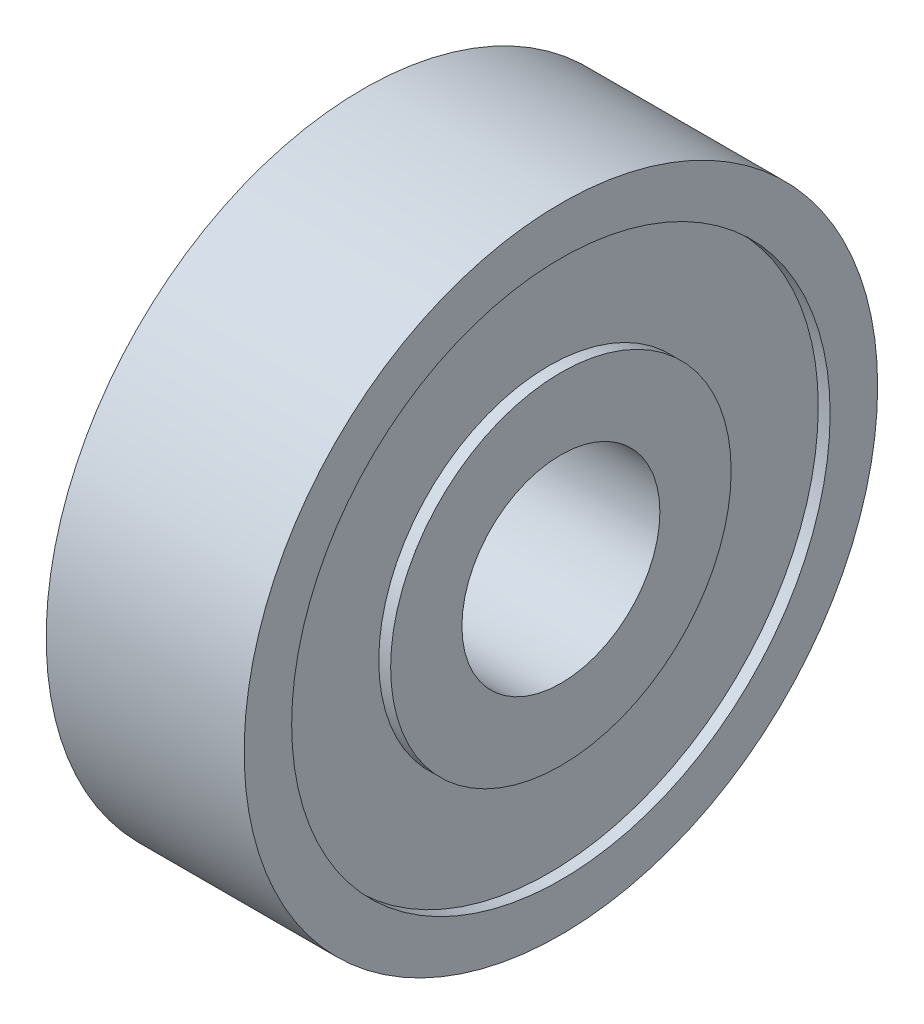
ISO-10303-21;
HEADER;
FILE_DESCRIPTION(('STEP AP214'),'2;1');
FILE_NAME('part.step','',(''),(''),'','','');
FILE_SCHEMA(('AUTOMOTIVE_DESIGN { 1 0 10303 214 1 1 1 1 }'));
ENDSEC;
DATA;
#1=APPLICATION_CONTEXT('core data for automotive mechanical design processes');
#2=APPLICATION_PROTOCOL_DEFINITION('international standard','automotive_design',2000,#1);
#3=PRODUCT_CONTEXT('',#1,'mechanical');
#4=PRODUCT('Part','Part','',(#3));
#5=PRODUCT_RELATED_PRODUCT_CATEGORY('part','',(#4));
#6=PRODUCT_DEFINITION_FORMATION('','',#4);
#7=PRODUCT_DEFINITION_CONTEXT('part definition',#1,'design');
#8=PRODUCT_DEFINITION('design','',#6,#7);
#9=PRODUCT_DEFINITION_SHAPE('','',#8);
#10=(LENGTH_UNIT() NAMED_UNIT(*) SI_UNIT(.MILLI.,.METRE.));
#11=(NAMED_UNIT(*) PLANE_ANGLE_UNIT() SI_UNIT($,.RADIAN.));
#12=(NAMED_UNIT(*) SI_UNIT($,.STERADIAN.) SOLID_ANGLE_UNIT());
#13=UNCERTAINTY_MEASURE_WITH_UNIT(LENGTH_MEASURE(1.E-05),#10,'distance_accuracy_value','');
#14=(GEOMETRIC_REPRESENTATION_CONTEXT(3) GLOBAL_UNCERTAINTY_ASSIGNED_CONTEXT((#13)) GLOBAL_UNIT_ASSIGNED_CONTEXT((#10,
#11,#12)) REPRESENTATION_CONTEXT('',''));
#15=CARTESIAN_POINT('',(0.,0.,0.));
#16=DIRECTION('',(0.,0.,1.));
#17=DIRECTION('',(1.,0.,0.));
#18=AXIS2_PLACEMENT_3D('',#15,#16,#17);
#19=CARTESIAN_POINT('',(-2.5,2.50000000000006,0.));
#20=DIRECTION('',(-1.,0.,0.));
#21=DIRECTION('',(0.,0.,1.));
#22=AXIS2_PLACEMENT_3D('',#19,#20,#21);
#23=PLANE('',#22);
#24=CARTESIAN_POINT('',(-2.5,0.,0.));
#25=DIRECTION('',(1.,0.,0.));
#26=DIRECTION('',(0.,0.,-1.));
#27=AXIS2_PLACEMENT_3D('',#24,#25,#26);
#28=CIRCLE('',#27,2.5);
#29=CARTESIAN_POINT('',(-2.5,0.,-2.5));
#30=VERTEX_POINT('',#29);
#31=EDGE_CURVE('E82',#30,#30,#28,.T.);
#32=ORIENTED_EDGE('',*,*,#31,.T.);
#33=EDGE_LOOP('',(#32));
#34=FACE_BOUND('',#33,.T.);
#35=CARTESIAN_POINT('',(-2.5,0.,0.));
#36=DIRECTION('',(1.,0.,0.));
#37=DIRECTION('',(0.,0.,-1.));
#38=AXIS2_PLACEMENT_3D('',#35,#36,#37);
#39=CIRCLE('',#38,4.3);
#40=CARTESIAN_POINT('',(-2.5,0.,-4.3));
#41=VERTEX_POINT('',#40);
#42=EDGE_CURVE('E12',#41,#41,#39,.T.);
#43=ORIENTED_EDGE('',*,*,#42,.F.);
#44=EDGE_LOOP('',(#43));
#45=FACE_BOUND('',#44,.T.);
#46=ADVANCED_FACE('F42',(#34,#45),#23,.T.);
#47=CARTESIAN_POINT('',(0.,0.,0.));
#48=DIRECTION('',(1.,0.,0.));
#49=DIRECTION('',(0.,0.,-1.));
#50=AXIS2_PLACEMENT_3D('',#47,#48,#49);
#51=CYLINDRICAL_SURFACE('',#50,4.3);
#52=ORIENTED_EDGE('',*,*,#42,.T.);
#53=EDGE_LOOP('',(#52));
#54=FACE_BOUND('',#53,.T.);
#55=CARTESIAN_POINT('',(-2.20000000000004,0.,0.));
#56=DIRECTION('',(1.,0.,0.));
#57=DIRECTION('',(0.,0.,-1.));
#58=AXIS2_PLACEMENT_3D('',#55,#56,#57);
#59=CIRCLE('',#58,4.3);
#60=CARTESIAN_POINT('',(-2.20000000000003,0.,-4.3));
#61=VERTEX_POINT('',#60);
#62=EDGE_CURVE('E48',#61,#61,#59,.T.);
#63=ORIENTED_EDGE('',*,*,#62,.F.);
#64=EDGE_LOOP('',(#63));
#65=FACE_BOUND('',#64,.T.);
#66=ADVANCED_FACE('F100',(#54,#65),#51,.T.);
#67=CARTESIAN_POINT('',(-2.19999999999998,4.29999999999997,0.));
#68=DIRECTION('',(-1.,0.,0.));
#69=DIRECTION('',(0.,0.,1.));
#70=AXIS2_PLACEMENT_3D('',#67,#68,#69);
#71=PLANE('',#70);
#72=ORIENTED_EDGE('',*,*,#62,.T.);
#73=EDGE_LOOP('',(#72));
#74=FACE_BOUND('',#73,.T.);
#75=CARTESIAN_POINT('',(-2.20000000000004,0.,0.));
#76=DIRECTION('',(1.,0.,0.));
#77=DIRECTION('',(0.,0.,-1.));
#78=AXIS2_PLACEMENT_3D('',#75,#76,#77);
#79=CIRCLE('',#78,6.8);
#80=CARTESIAN_POINT('',(-2.20000000000003,0.,-6.80000000000001));
#81=VERTEX_POINT('',#80);
#82=EDGE_CURVE('E52',#81,#81,#79,.T.);
#83=ORIENTED_EDGE('',*,*,#82,.F.);
#84=EDGE_LOOP('',(#83));
#85=FACE_BOUND('',#84,.T.);
#86=ADVANCED_FACE('F104',(#74,#85),#71,.T.);
#87=CARTESIAN_POINT('',(0.,0.,0.));
#88=DIRECTION('',(1.,0.,0.));
#89=DIRECTION('',(0.,0.,-1.));
#90=AXIS2_PLACEMENT_3D('',#87,#88,#89);
#91=CYLINDRICAL_SURFACE('',#90,6.8);
#92=ORIENTED_EDGE('',*,*,#82,.T.);
#93=EDGE_LOOP('',(#92));
#94=FACE_BOUND('',#93,.T.);
#95=CARTESIAN_POINT('',(-2.5,0.,0.));
#96=DIRECTION('',(1.,0.,0.));
#97=DIRECTION('',(0.,0.,-1.));
#98=AXIS2_PLACEMENT_3D('',#95,#96,#97);
#99=CIRCLE('',#98,6.8);
#100=CARTESIAN_POINT('',(-2.5,0.,-6.80000000000001));
#101=VERTEX_POINT('',#100);
#102=EDGE_CURVE('E56',#101,#101,#99,.T.);
#103=ORIENTED_EDGE('',*,*,#102,.F.);
#104=EDGE_LOOP('',(#103));
#105=FACE_BOUND('',#104,.T.);
#106=ADVANCED_FACE('F108',(#94,#105),#91,.F.);
#107=CARTESIAN_POINT('',(-2.5,6.79999999999992,0.));
#108=DIRECTION('',(-1.,0.,0.));
#109=DIRECTION('',(0.,0.,1.));
#110=AXIS2_PLACEMENT_3D('',#107,#108,#109);
#111=PLANE('',#110);
#112=ORIENTED_EDGE('',*,*,#102,.T.);
#113=EDGE_LOOP('',(#112));
#114=FACE_BOUND('',#113,.T.);
#115=CARTESIAN_POINT('',(-2.5,0.,0.));
#116=DIRECTION('',(1.,0.,0.));
#117=DIRECTION('',(0.,0.,-1.));
#118=AXIS2_PLACEMENT_3D('',#115,#116,#117);
#119=CIRCLE('',#118,8.);
#120=CARTESIAN_POINT('',(-2.5,0.,-8.00000000000001));
#121=VERTEX_POINT('',#120);
#122=EDGE_CURVE('E61',#121,#121,#119,.T.);
#123=ORIENTED_EDGE('',*,*,#122,.F.);
#124=EDGE_LOOP('',(#123));
#125=FACE_BOUND('',#124,.T.);
#126=ADVANCED_FACE('F114',(#114,#125),#111,.T.);
#127=CARTESIAN_POINT('',(0.,0.,0.));
#128=DIRECTION('',(1.,0.,0.));
#129=DIRECTION('',(0.,0.,-1.));
#130=AXIS2_PLACEMENT_3D('',#127,#128,#129);
#131=CYLINDRICAL_SURFACE('',#130,8.);
#132=ORIENTED_EDGE('',*,*,#122,.T.);
#133=EDGE_LOOP('',(#132));
#134=FACE_BOUND('',#133,.T.);
#135=CARTESIAN_POINT('',(2.5,0.,0.));
#136=DIRECTION('',(1.,0.,0.));
#137=DIRECTION('',(0.,0.,-1.));
#138=AXIS2_PLACEMENT_3D('',#135,#136,#137);
#139=CIRCLE('',#138,8.);
#140=CARTESIAN_POINT('',(2.5,0.,-8.00000000000001));
#141=VERTEX_POINT('',#140);
#142=EDGE_CURVE('E64',#141,#141,#139,.T.);
#143=ORIENTED_EDGE('',*,*,#142,.F.);
#144=EDGE_LOOP('',(#143));
#145=FACE_BOUND('',#144,.T.);
#146=ADVANCED_FACE('F118',(#134,#145),#131,.T.);
#147=CARTESIAN_POINT('',(2.5,6.79999999999992,0.));
#148=DIRECTION('',(1.,0.,0.));
#149=DIRECTION('',(0.,0.,-1.));
#150=AXIS2_PLACEMENT_3D('',#147,#148,#149);
#151=PLANE('',#150);
#152=ORIENTED_EDGE('',*,*,#142,.T.);
#153=EDGE_LOOP('',(#152));
#154=FACE_BOUND('',#153,.T.);
#155=CARTESIAN_POINT('',(2.5,0.,0.));
#156=DIRECTION('',(1.,0.,0.));
#157=DIRECTION('',(0.,0.,-1.));
#158=AXIS2_PLACEMENT_3D('',#155,#156,#157);
#159=CIRCLE('',#158,6.8);
#160=CARTESIAN_POINT('',(2.5,0.,-6.80000000000001));
#161=VERTEX_POINT('',#160);
#162=EDGE_CURVE('E67',#161,#161,#159,.T.);
#163=ORIENTED_EDGE('',*,*,#162,.F.);
#164=EDGE_LOOP('',(#163));
#165=FACE_BOUND('',#164,.T.);
#166=ADVANCED_FACE('F122',(#154,#165),#151,.T.);
#167=CARTESIAN_POINT('',(0.,0.,0.));
#168=DIRECTION('',(1.,0.,0.));
#169=DIRECTION('',(0.,0.,-1.));
#170=AXIS2_PLACEMENT_3D('',#167,#168,#169);
#171=CYLINDRICAL_SURFACE('',#170,6.8);
#172=ORIENTED_EDGE('',*,*,#162,.T.);
#173=EDGE_LOOP('',(#172));
#174=FACE_BOUND('',#173,.T.);
#175=CARTESIAN_POINT('',(2.20000000000004,0.,0.));
#176=DIRECTION('',(1.,0.,0.));
#177=DIRECTION('',(0.,0.,-1.));
#178=AXIS2_PLACEMENT_3D('',#175,#176,#177);
#179=CIRCLE('',#178,6.8);
#180=CARTESIAN_POINT('',(2.20000000000004,0.,-6.80000000000001));
#181=VERTEX_POINT('',#180);
#182=EDGE_CURVE('E70',#181,#181,#179,.T.);
#183=ORIENTED_EDGE('',*,*,#182,.F.);
#184=EDGE_LOOP('',(#183));
#185=FACE_BOUND('',#184,.T.);
#186=ADVANCED_FACE('F126',(#174,#185),#171,.F.);
#187=CARTESIAN_POINT('',(2.20000000000004,4.29999999999997,0.));
#188=DIRECTION('',(1.,0.,0.));
#189=DIRECTION('',(0.,0.,-1.));
#190=AXIS2_PLACEMENT_3D('',#187,#188,#189);
#191=PLANE('',#190);
#192=ORIENTED_EDGE('',*,*,#182,.T.);
#193=EDGE_LOOP('',(#192));
#194=FACE_BOUND('',#193,.T.);
#195=CARTESIAN_POINT('',(2.20000000000004,0.,0.));
#196=DIRECTION('',(1.,0.,0.));
#197=DIRECTION('',(0.,0.,-1.));
#198=AXIS2_PLACEMENT_3D('',#195,#196,#197);
#199=CIRCLE('',#198,4.3);
#200=CARTESIAN_POINT('',(2.20000000000004,0.,-4.3));
#201=VERTEX_POINT('',#200);
#202=EDGE_CURVE('E73',#201,#201,#199,.T.);
#203=ORIENTED_EDGE('',*,*,#202,.F.);
#204=EDGE_LOOP('',(#203));
#205=FACE_BOUND('',#204,.T.);
#206=ADVANCED_FACE('F130',(#194,#205),#191,.T.);
#207=CARTESIAN_POINT('',(0.,0.,0.));
#208=DIRECTION('',(1.,0.,0.));
#209=DIRECTION('',(0.,0.,-1.));
#210=AXIS2_PLACEMENT_3D('',#207,#208,#209);
#211=CYLINDRICAL_SURFACE('',#210,4.3);
#212=ORIENTED_EDGE('',*,*,#202,.T.);
#213=EDGE_LOOP('',(#212));
#214=FACE_BOUND('',#213,.T.);
#215=CARTESIAN_POINT('',(2.5,0.,0.));
#216=DIRECTION('',(1.,0.,0.));
#217=DIRECTION('',(0.,0.,-1.));
#218=AXIS2_PLACEMENT_3D('',#215,#216,#217);
#219=CIRCLE('',#218,4.3);
#220=CARTESIAN_POINT('',(2.5,0.,-4.3));
#221=VERTEX_POINT('',#220);
#222=EDGE_CURVE('E76',#221,#221,#219,.T.);
#223=ORIENTED_EDGE('',*,*,#222,.F.);
#224=EDGE_LOOP('',(#223));
#225=FACE_BOUND('',#224,.T.);
#226=ADVANCED_FACE('F96',(#214,#225),#211,.T.);
#227=CARTESIAN_POINT('',(2.5,2.50000000000006,0.));
#228=DIRECTION('',(1.,0.,0.));
#229=DIRECTION('',(0.,0.,-1.));
#230=AXIS2_PLACEMENT_3D('',#227,#228,#229);
#231=PLANE('',#230);
#232=ORIENTED_EDGE('',*,*,#222,.T.);
#233=EDGE_LOOP('',(#232));
#234=FACE_BOUND('',#233,.T.);
#235=CARTESIAN_POINT('',(2.5,0.,0.));
#236=DIRECTION('',(1.,0.,0.));
#237=DIRECTION('',(0.,0.,-1.));
#238=AXIS2_PLACEMENT_3D('',#235,#236,#237);
#239=CIRCLE('',#238,2.5);
#240=CARTESIAN_POINT('',(2.5,0.,-2.5));
#241=VERTEX_POINT('',#240);
#242=EDGE_CURVE('E79',#241,#241,#239,.T.);
#243=ORIENTED_EDGE('',*,*,#242,.F.);
#244=EDGE_LOOP('',(#243));
#245=FACE_BOUND('',#244,.T.);
#246=ADVANCED_FACE('F90',(#234,#245),#231,.T.);
#247=CARTESIAN_POINT('',(0.,0.,0.));
#248=DIRECTION('',(1.,0.,0.));
#249=DIRECTION('',(0.,0.,-1.));
#250=AXIS2_PLACEMENT_3D('',#247,#248,#249);
#251=CYLINDRICAL_SURFACE('',#250,2.5);
#252=ORIENTED_EDGE('',*,*,#242,.T.);
#253=EDGE_LOOP('',(#252));
#254=FACE_BOUND('',#253,.T.);
#255=ORIENTED_EDGE('',*,*,#31,.F.);
#256=EDGE_LOOP('',(#255));
#257=FACE_BOUND('',#256,.T.);
#258=ADVANCED_FACE('F88',(#254,#257),#251,.F.);
#259=CLOSED_SHELL('',(#46,#66,#86,#106,#126,#146,#166,#186,#206,#226,#246,#258));
#260=MANIFOLD_SOLID_BREP('B2',#259);
#261=ADVANCED_BREP_SHAPE_REPRESENTATION('',(#18,#260),#14);
#262=SHAPE_DEFINITION_REPRESENTATION(#9,#261);
ENDSEC;
END-ISO-10303-21;
